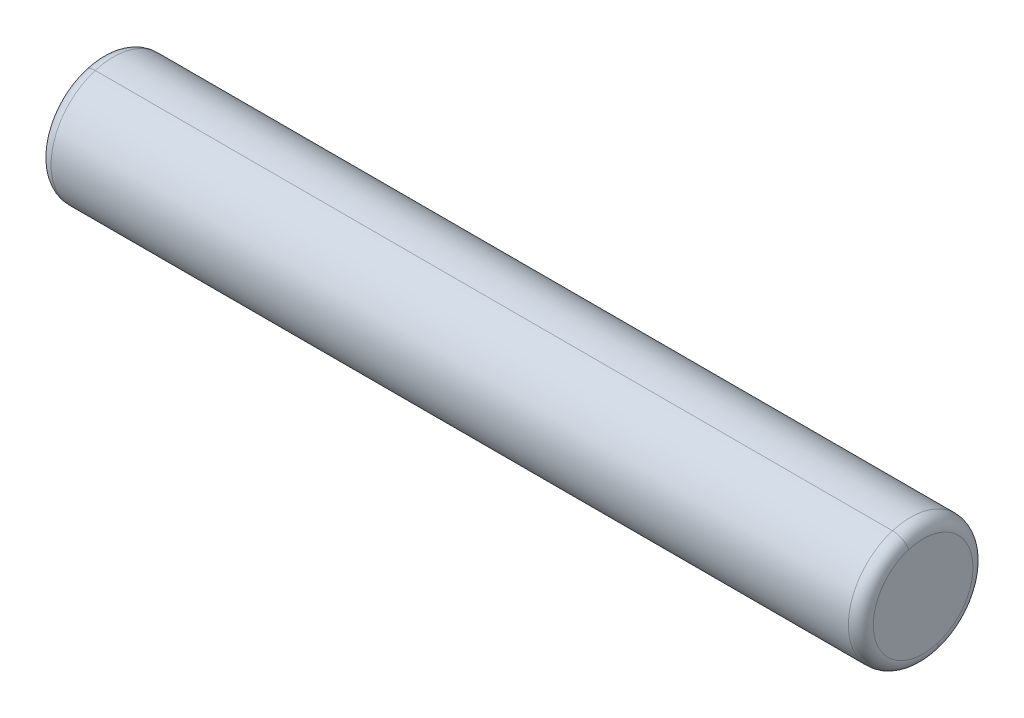
ISO-10303-21;
HEADER;
FILE_DESCRIPTION(('STEP AP214'),'2;1');
FILE_NAME('part.step','',(''),(''),'','','');
FILE_SCHEMA(('AUTOMOTIVE_DESIGN { 1 0 10303 214 1 1 1 1 }'));
ENDSEC;
DATA;
#1=APPLICATION_CONTEXT('core data for automotive mechanical design processes');
#2=APPLICATION_PROTOCOL_DEFINITION('international standard','automotive_design',2000,#1);
#3=PRODUCT_CONTEXT('',#1,'mechanical');
#4=PRODUCT('Part','Part','',(#3));
#5=PRODUCT_RELATED_PRODUCT_CATEGORY('part','',(#4));
#6=PRODUCT_DEFINITION_FORMATION('','',#4);
#7=PRODUCT_DEFINITION_CONTEXT('part definition',#1,'design');
#8=PRODUCT_DEFINITION('design','',#6,#7);
#9=PRODUCT_DEFINITION_SHAPE('','',#8);
#10=(LENGTH_UNIT() NAMED_UNIT(*) SI_UNIT(.MILLI.,.METRE.));
#11=(NAMED_UNIT(*) PLANE_ANGLE_UNIT() SI_UNIT($,.RADIAN.));
#12=(NAMED_UNIT(*) SI_UNIT($,.STERADIAN.) SOLID_ANGLE_UNIT());
#13=UNCERTAINTY_MEASURE_WITH_UNIT(LENGTH_MEASURE(1.E-05),#10,'distance_accuracy_value','');
#14=(GEOMETRIC_REPRESENTATION_CONTEXT(3) GLOBAL_UNCERTAINTY_ASSIGNED_CONTEXT((#13)) GLOBAL_UNIT_ASSIGNED_CONTEXT((#10,
#11,#12)) REPRESENTATION_CONTEXT('',''));
#15=CARTESIAN_POINT('',(0.,0.,0.));
#16=DIRECTION('',(0.,0.,1.));
#17=DIRECTION('',(1.,0.,0.));
#18=AXIS2_PLACEMENT_3D('',#15,#16,#17);
#19=CARTESIAN_POINT('',(38.3150151432416,51.8785267638244,63.284889221384));
#20=DIRECTION('',(1.,0.,0.));
#21=DIRECTION('',(0.,0.956812695658852,0.290705117646804));
#22=AXIS2_PLACEMENT_3D('',#19,#20,#21);
#23=TOROIDAL_SURFACE('',#22,0.6,0.15);
#24=CARTESIAN_POINT('',(38.3150151432416,51.8785267638244,63.284889221384));
#25=DIRECTION('',(-1.,0.,0.));
#26=DIRECTION('',(0.,0.956812695658863,0.290705117646764));
#27=AXIS2_PLACEMENT_3D('',#24,#25,#26);
#28=CIRCLE('',#27,0.75);
#29=CARTESIAN_POINT('',(38.3150151432416,51.1609172420802,63.0668603831489));
#30=VERTEX_POINT('',#29);
#31=CARTESIAN_POINT('',(38.3150151432416,52.5961362855685,63.5029180596191));
#32=VERTEX_POINT('',#31);
#33=EDGE_CURVE('E85',#30,#32,#28,.T.);
#34=ORIENTED_EDGE('',*,*,#33,.F.);
#35=CARTESIAN_POINT('',(38.3150151432416,51.3044391464291,63.1104661507959));
#36=DIRECTION('',(0.,-0.290705117646789,0.956812695658856));
#37=DIRECTION('',(0.,-0.956812695658856,-0.290705117646789));
#38=AXIS2_PLACEMENT_3D('',#35,#36,#37);
#39=CIRCLE('',#38,0.149999999999997);
#40=CARTESIAN_POINT('',(38.4650151432416,51.3044391464291,63.1104661507959));
#41=VERTEX_POINT('',#40);
#42=EDGE_CURVE('E13',#30,#41,#39,.T.);
#43=ORIENTED_EDGE('',*,*,#42,.T.);
#44=CARTESIAN_POINT('',(38.4650151432416,51.8785267638244,63.284889221384));
#45=DIRECTION('',(1.,0.,0.));
#46=DIRECTION('',(0.,0.956812695658851,0.290705117646807));
#47=AXIS2_PLACEMENT_3D('',#44,#45,#46);
#48=CIRCLE('',#47,0.6);
#49=CARTESIAN_POINT('',(38.4650151432416,52.4526143812197,63.4593122919721));
#50=VERTEX_POINT('',#49);
#51=EDGE_CURVE('E87',#50,#41,#48,.T.);
#52=ORIENTED_EDGE('',*,*,#51,.F.);
#53=CARTESIAN_POINT('',(38.3150151432416,52.4526143812197,63.4593122919721));
#54=DIRECTION('',(0.,0.290705117646789,-0.956812695658856));
#55=DIRECTION('',(0.,0.956812695658856,0.290705117646789));
#56=AXIS2_PLACEMENT_3D('',#53,#54,#55);
#57=CIRCLE('',#56,0.149999999999997);
#58=EDGE_CURVE('E78',#32,#50,#57,.T.);
#59=ORIENTED_EDGE('',*,*,#58,.F.);
#60=EDGE_LOOP('',(#34,#43,#52,#59));
#61=FACE_BOUND('',#60,.T.);
#62=ADVANCED_FACE('F25',(#61),#23,.T.);
#63=CARTESIAN_POINT('',(28.7150151432416,51.8785267638244,63.2848892213841));
#64=DIRECTION('',(1.,0.,0.));
#65=DIRECTION('',(0.,0.956812695658852,0.290705117646804));
#66=AXIS2_PLACEMENT_3D('',#63,#64,#65);
#67=TOROIDAL_SURFACE('',#66,0.6,0.15);
#68=CARTESIAN_POINT('',(28.5650151432416,51.8785267638244,63.2848892213841));
#69=DIRECTION('',(-1.,0.,0.));
#70=DIRECTION('',(0.,0.956812695658851,0.290705117646807));
#71=AXIS2_PLACEMENT_3D('',#68,#69,#70);
#72=CIRCLE('',#71,0.6);
#73=CARTESIAN_POINT('',(28.5650151432416,51.3044391464291,63.110466150796));
#74=VERTEX_POINT('',#73);
#75=CARTESIAN_POINT('',(28.5650151432416,52.4526143812197,63.4593122919722));
#76=VERTEX_POINT('',#75);
#77=EDGE_CURVE('E117',#74,#76,#72,.T.);
#78=ORIENTED_EDGE('',*,*,#77,.F.);
#79=CARTESIAN_POINT('',(28.7150151432416,51.3044391464291,63.110466150796));
#80=DIRECTION('',(0.,-0.290705117646789,0.956812695658856));
#81=DIRECTION('',(0.,-0.956812695658856,-0.290705117646789));
#82=AXIS2_PLACEMENT_3D('',#79,#80,#81);
#83=CIRCLE('',#82,0.149999999999997);
#84=CARTESIAN_POINT('',(28.7150151432416,51.1609172420803,63.0668603831489));
#85=VERTEX_POINT('',#84);
#86=EDGE_CURVE('E36',#74,#85,#83,.T.);
#87=ORIENTED_EDGE('',*,*,#86,.T.);
#88=CARTESIAN_POINT('',(28.7150151432416,51.8785267638244,63.2848892213841));
#89=DIRECTION('',(1.,0.,0.));
#90=DIRECTION('',(0.,0.956812695658852,0.290705117646804));
#91=AXIS2_PLACEMENT_3D('',#88,#89,#90);
#92=CIRCLE('',#91,0.75);
#93=CARTESIAN_POINT('',(28.7150151432417,52.5961362855685,63.5029180596192));
#94=VERTEX_POINT('',#93);
#95=EDGE_CURVE('E101',#94,#85,#92,.T.);
#96=ORIENTED_EDGE('',*,*,#95,.F.);
#97=CARTESIAN_POINT('',(28.7150151432417,52.4526143812197,63.4593122919722));
#98=DIRECTION('',(0.,0.290705117646789,-0.956812695658856));
#99=DIRECTION('',(0.,0.956812695658856,0.290705117646789));
#100=AXIS2_PLACEMENT_3D('',#97,#98,#99);
#101=CIRCLE('',#100,0.149999999999997);
#102=EDGE_CURVE('E90',#76,#94,#101,.T.);
#103=ORIENTED_EDGE('',*,*,#102,.F.);
#104=EDGE_LOOP('',(#78,#87,#96,#103));
#105=FACE_BOUND('',#104,.T.);
#106=ADVANCED_FACE('F145',(#105),#67,.T.);
#107=CARTESIAN_POINT('',(38.4650151432416,51.8785267638244,63.284889221384));
#108=DIRECTION('',(-1.,0.,0.));
#109=DIRECTION('',(0.,-0.956812695658852,-0.290705117646804));
#110=AXIS2_PLACEMENT_3D('',#107,#108,#109);
#111=CYLINDRICAL_SURFACE('',#110,0.75);
#112=ORIENTED_EDGE('',*,*,#33,.T.);
#113=DIRECTION('',(-1.,0.,0.));
#114=VECTOR('',#113,1.);
#115=CARTESIAN_POINT('',(38.4650151432416,52.5961362855685,63.5029180596191));
#116=LINE('',#115,#114);
#117=EDGE_CURVE('E96',#32,#94,#116,.T.);
#118=ORIENTED_EDGE('',*,*,#117,.T.);
#119=ORIENTED_EDGE('',*,*,#95,.T.);
#120=DIRECTION('',(-1.,0.,0.));
#121=VECTOR('',#120,1.);
#122=CARTESIAN_POINT('',(38.4650151432416,51.1609172420802,63.0668603831489));
#123=LINE('',#122,#121);
#124=EDGE_CURVE('E51',#30,#85,#123,.T.);
#125=ORIENTED_EDGE('',*,*,#124,.F.);
#126=EDGE_LOOP('',(#112,#118,#119,#125));
#127=FACE_BOUND('',#126,.T.);
#128=ADVANCED_FACE('F103',(#127),#111,.T.);
#129=CARTESIAN_POINT('',(38.4650151432416,51.8785267638244,63.284889221384));
#130=DIRECTION('',(-1.,0.,0.));
#131=DIRECTION('',(0.,-0.956812695658852,-0.290705117646804));
#132=AXIS2_PLACEMENT_3D('',#129,#130,#131);
#133=CYLINDRICAL_SURFACE('',#132,0.75);
#134=ORIENTED_EDGE('',*,*,#117,.F.);
#135=CARTESIAN_POINT('',(38.3150151432416,51.8785267638244,63.284889221384));
#136=DIRECTION('',(-1.,0.,0.));
#137=DIRECTION('',(0.,0.956812695658846,0.29070511764682));
#138=AXIS2_PLACEMENT_3D('',#135,#136,#137);
#139=CIRCLE('',#138,0.75);
#140=EDGE_CURVE('E98',#32,#30,#139,.T.);
#141=ORIENTED_EDGE('',*,*,#140,.T.);
#142=ORIENTED_EDGE('',*,*,#124,.T.);
#143=CARTESIAN_POINT('',(28.7150151432416,51.8785267638244,63.2848892213841));
#144=DIRECTION('',(1.,0.,0.));
#145=DIRECTION('',(0.,0.956812695658852,0.290705117646804));
#146=AXIS2_PLACEMENT_3D('',#143,#144,#145);
#147=CIRCLE('',#146,0.75);
#148=EDGE_CURVE('E29',#85,#94,#147,.T.);
#149=ORIENTED_EDGE('',*,*,#148,.T.);
#150=EDGE_LOOP('',(#134,#141,#142,#149));
#151=FACE_BOUND('',#150,.T.);
#152=ADVANCED_FACE('F97',(#151),#133,.T.);
#153=CARTESIAN_POINT('',(38.4650151432416,51.8785267638244,63.284889221384));
#154=DIRECTION('',(1.,0.,0.));
#155=DIRECTION('',(0.,0.,-1.));
#156=AXIS2_PLACEMENT_3D('',#153,#154,#155);
#157=PLANE('',#156);
#158=ORIENTED_EDGE('',*,*,#51,.T.);
#159=CARTESIAN_POINT('',(38.4650151432416,51.8785267638244,63.284889221384));
#160=DIRECTION('',(1.,0.,0.));
#161=DIRECTION('',(0.,0.956812695658851,0.290705117646807));
#162=AXIS2_PLACEMENT_3D('',#159,#160,#161);
#163=CIRCLE('',#162,0.6);
#164=EDGE_CURVE('E118',#41,#50,#163,.T.);
#165=ORIENTED_EDGE('',*,*,#164,.T.);
#166=EDGE_LOOP('',(#158,#165));
#167=FACE_BOUND('',#166,.T.);
#168=ADVANCED_FACE('F173',(#167),#157,.T.);
#169=CARTESIAN_POINT('',(28.5650151432416,51.8785267638244,63.2848892213841));
#170=DIRECTION('',(1.,0.,0.));
#171=DIRECTION('',(0.,0.,-1.));
#172=AXIS2_PLACEMENT_3D('',#169,#170,#171);
#173=PLANE('',#172);
#174=CARTESIAN_POINT('',(28.5650151432416,51.8785267638244,63.2848892213841));
#175=DIRECTION('',(-1.,0.,0.));
#176=DIRECTION('',(0.,0.956812695658851,0.290705117646807));
#177=AXIS2_PLACEMENT_3D('',#174,#175,#176);
#178=CIRCLE('',#177,0.6);
#179=EDGE_CURVE('E121',#76,#74,#178,.T.);
#180=ORIENTED_EDGE('',*,*,#179,.T.);
#181=ORIENTED_EDGE('',*,*,#77,.T.);
#182=EDGE_LOOP('',(#180,#181));
#183=FACE_BOUND('',#182,.T.);
#184=ADVANCED_FACE('F136',(#183),#173,.F.);
#185=CARTESIAN_POINT('',(28.7150151432416,51.8785267638244,63.2848892213841));
#186=DIRECTION('',(1.,0.,0.));
#187=DIRECTION('',(0.,0.956812695658852,0.290705117646804));
#188=AXIS2_PLACEMENT_3D('',#185,#186,#187);
#189=TOROIDAL_SURFACE('',#188,0.6,0.15);
#190=ORIENTED_EDGE('',*,*,#86,.F.);
#191=ORIENTED_EDGE('',*,*,#179,.F.);
#192=ORIENTED_EDGE('',*,*,#102,.T.);
#193=ORIENTED_EDGE('',*,*,#148,.F.);
#194=EDGE_LOOP('',(#190,#191,#192,#193));
#195=FACE_BOUND('',#194,.T.);
#196=ADVANCED_FACE('F27',(#195),#189,.T.);
#197=CARTESIAN_POINT('',(38.3150151432416,51.8785267638244,63.284889221384));
#198=DIRECTION('',(1.,0.,0.));
#199=DIRECTION('',(0.,0.956812695658852,0.290705117646804));
#200=AXIS2_PLACEMENT_3D('',#197,#198,#199);
#201=TOROIDAL_SURFACE('',#200,0.6,0.15);
#202=ORIENTED_EDGE('',*,*,#42,.F.);
#203=ORIENTED_EDGE('',*,*,#140,.F.);
#204=ORIENTED_EDGE('',*,*,#58,.T.);
#205=ORIENTED_EDGE('',*,*,#164,.F.);
#206=EDGE_LOOP('',(#202,#203,#204,#205));
#207=FACE_BOUND('',#206,.T.);
#208=ADVANCED_FACE('F106',(#207),#201,.T.);
#209=CLOSED_SHELL('',(#62,#106,#128,#152,#168,#184,#196,#208));
#210=MANIFOLD_SOLID_BREP('B1',#209);
#211=ADVANCED_BREP_SHAPE_REPRESENTATION('',(#18,#210),#14);
#212=SHAPE_DEFINITION_REPRESENTATION(#9,#211);
ENDSEC;
END-ISO-10303-21;
